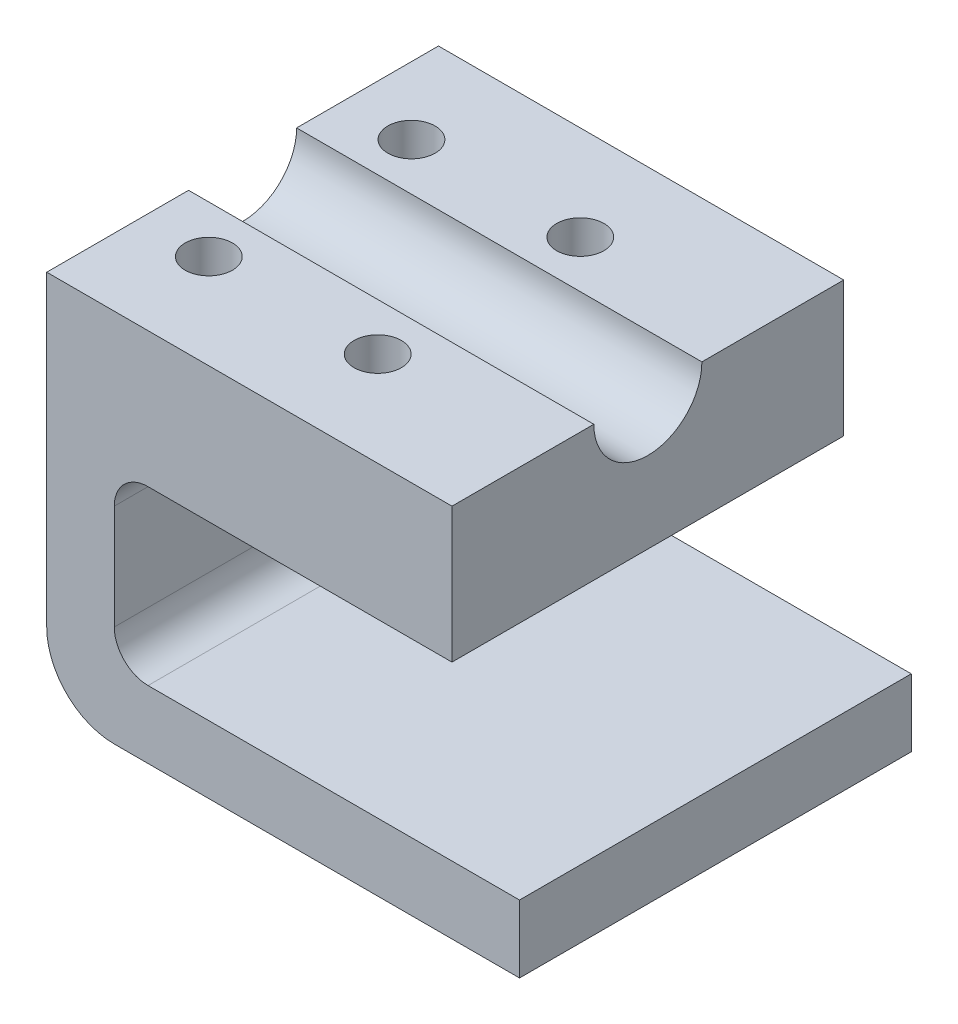
ISO-10303-21;
HEADER;
FILE_DESCRIPTION(('STEP AP214'),'2;1');
FILE_NAME('part.step','',(''),(''),'','','');
FILE_SCHEMA(('AUTOMOTIVE_DESIGN { 1 0 10303 214 1 1 1 1 }'));
ENDSEC;
DATA;
#1=APPLICATION_CONTEXT('core data for automotive mechanical design processes');
#2=APPLICATION_PROTOCOL_DEFINITION('international standard','automotive_design',2000,#1);
#3=PRODUCT_CONTEXT('',#1,'mechanical');
#4=PRODUCT('Part','Part','',(#3));
#5=PRODUCT_RELATED_PRODUCT_CATEGORY('part','',(#4));
#6=PRODUCT_DEFINITION_FORMATION('','',#4);
#7=PRODUCT_DEFINITION_CONTEXT('part definition',#1,'design');
#8=PRODUCT_DEFINITION('design','',#6,#7);
#9=PRODUCT_DEFINITION_SHAPE('','',#8);
#10=(LENGTH_UNIT() NAMED_UNIT(*) SI_UNIT(.MILLI.,.METRE.));
#11=(NAMED_UNIT(*) PLANE_ANGLE_UNIT() SI_UNIT($,.RADIAN.));
#12=(NAMED_UNIT(*) SI_UNIT($,.STERADIAN.) SOLID_ANGLE_UNIT());
#13=UNCERTAINTY_MEASURE_WITH_UNIT(LENGTH_MEASURE(1.E-05),#10,'distance_accuracy_value','');
#14=(GEOMETRIC_REPRESENTATION_CONTEXT(3) GLOBAL_UNCERTAINTY_ASSIGNED_CONTEXT((#13)) GLOBAL_UNIT_ASSIGNED_CONTEXT((#10,
#11,#12)) REPRESENTATION_CONTEXT('',''));
#15=CARTESIAN_POINT('',(0.,0.,0.));
#16=DIRECTION('',(0.,0.,1.));
#17=DIRECTION('',(1.,0.,0.));
#18=AXIS2_PLACEMENT_3D('',#15,#16,#17);
#19=CARTESIAN_POINT('',(-10.,45.5,58.));
#20=DIRECTION('',(0.,-1.,0.));
#21=DIRECTION('',(0.,0.,-1.));
#22=AXIS2_PLACEMENT_3D('',#19,#20,#21);
#23=PLANE('',#22);
#24=CARTESIAN_POINT('',(0.,45.5,44.));
#25=DIRECTION('',(0.,1.,0.));
#26=DIRECTION('',(0.,0.,1.));
#27=AXIS2_PLACEMENT_3D('',#24,#25,#26);
#28=CIRCLE('',#27,3.5);
#29=CARTESIAN_POINT('',(0.,45.5,47.5));
#30=VERTEX_POINT('',#29);
#31=EDGE_CURVE('E305',#30,#30,#28,.T.);
#32=ORIENTED_EDGE('',*,*,#31,.F.);
#33=EDGE_LOOP('',(#32));
#34=FACE_BOUND('',#33,.T.);
#35=CARTESIAN_POINT('',(25.,45.5,44.));
#36=DIRECTION('',(0.,1.,0.));
#37=DIRECTION('',(0.,0.,1.));
#38=AXIS2_PLACEMENT_3D('',#35,#36,#37);
#39=CIRCLE('',#38,3.5);
#40=CARTESIAN_POINT('',(25.,45.5,47.5));
#41=VERTEX_POINT('',#40);
#42=EDGE_CURVE('E315',#41,#41,#39,.T.);
#43=ORIENTED_EDGE('',*,*,#42,.F.);
#44=EDGE_LOOP('',(#43));
#45=FACE_BOUND('',#44,.T.);
#46=DIRECTION('',(0.,0.,-1.));
#47=VECTOR('',#46,1.);
#48=CARTESIAN_POINT('',(50.,45.5,58.));
#49=LINE('',#48,#47);
#50=CARTESIAN_POINT('',(50.,45.5,58.));
#51=VERTEX_POINT('',#50);
#52=CARTESIAN_POINT('',(50.,45.5,37.));
#53=VERTEX_POINT('',#52);
#54=EDGE_CURVE('E149',#51,#53,#49,.T.);
#55=ORIENTED_EDGE('',*,*,#54,.T.);
#56=DIRECTION('',(-1.,0.,0.));
#57=VECTOR('',#56,1.);
#58=CARTESIAN_POINT('',(50.,45.5,37.));
#59=LINE('',#58,#57);
#60=CARTESIAN_POINT('',(-10.,45.5,37.));
#61=VERTEX_POINT('',#60);
#62=EDGE_CURVE('E130',#53,#61,#59,.T.);
#63=ORIENTED_EDGE('',*,*,#62,.T.);
#64=DIRECTION('',(0.,0.,-1.));
#65=VECTOR('',#64,1.);
#66=CARTESIAN_POINT('',(-10.,45.5,58.));
#67=LINE('',#66,#65);
#68=CARTESIAN_POINT('',(-10.,45.5,58.));
#69=VERTEX_POINT('',#68);
#70=EDGE_CURVE('E160',#69,#61,#67,.T.);
#71=ORIENTED_EDGE('',*,*,#70,.F.);
#72=DIRECTION('',(-1.,0.,0.));
#73=VECTOR('',#72,1.);
#74=CARTESIAN_POINT('',(-10.,45.5,58.));
#75=LINE('',#74,#73);
#76=EDGE_CURVE('E155',#51,#69,#75,.T.);
#77=ORIENTED_EDGE('',*,*,#76,.F.);
#78=EDGE_LOOP('',(#55,#63,#71,#77));
#79=FACE_BOUND('',#78,.T.);
#80=ADVANCED_FACE('F37',(#34,#45,#79),#23,.F.);
#81=CARTESIAN_POINT('',(0.,0.,58.));
#82=DIRECTION('',(0.,-1.,0.));
#83=DIRECTION('',(0.,0.,-1.));
#84=AXIS2_PLACEMENT_3D('',#81,#82,#83);
#85=PLANE('',#84);
#86=DIRECTION('',(-1.,0.,0.));
#87=VECTOR('',#86,1.);
#88=CARTESIAN_POINT('',(0.,0.,0.));
#89=LINE('',#88,#87);
#90=CARTESIAN_POINT('',(60.,0.,0.));
#91=VERTEX_POINT('',#90);
#92=CARTESIAN_POINT('',(5.,0.,0.));
#93=VERTEX_POINT('',#92);
#94=EDGE_CURVE('E141',#91,#93,#89,.T.);
#95=ORIENTED_EDGE('',*,*,#94,.T.);
#96=DIRECTION('',(0.,0.,-1.));
#97=VECTOR('',#96,1.);
#98=CARTESIAN_POINT('',(5.,0.,58.));
#99=LINE('',#98,#97);
#100=CARTESIAN_POINT('',(5.,0.,58.));
#101=VERTEX_POINT('',#100);
#102=EDGE_CURVE('E170',#93,#101,#99,.F.);
#103=ORIENTED_EDGE('',*,*,#102,.T.);
#104=DIRECTION('',(-1.,0.,0.));
#105=VECTOR('',#104,1.);
#106=CARTESIAN_POINT('',(0.,0.,58.));
#107=LINE('',#106,#105);
#108=CARTESIAN_POINT('',(60.,0.,58.));
#109=VERTEX_POINT('',#108);
#110=EDGE_CURVE('E199',#109,#101,#107,.T.);
#111=ORIENTED_EDGE('',*,*,#110,.F.);
#112=DIRECTION('',(0.,0.,-1.));
#113=VECTOR('',#112,1.);
#114=CARTESIAN_POINT('',(60.,0.,58.));
#115=LINE('',#114,#113);
#116=EDGE_CURVE('E212',#109,#91,#115,.T.);
#117=ORIENTED_EDGE('',*,*,#116,.T.);
#118=EDGE_LOOP('',(#95,#103,#111,#117));
#119=FACE_BOUND('',#118,.T.);
#120=ADVANCED_FACE('F265',(#119),#85,.F.);
#121=CARTESIAN_POINT('',(0.,0.,58.));
#122=DIRECTION('',(-1.,0.,0.));
#123=DIRECTION('',(0.,0.,1.));
#124=AXIS2_PLACEMENT_3D('',#121,#122,#123);
#125=PLANE('',#124);
#126=DIRECTION('',(0.,1.,0.));
#127=VECTOR('',#126,1.);
#128=CARTESIAN_POINT('',(0.,0.,58.));
#129=LINE('',#128,#127);
#130=CARTESIAN_POINT('',(0.,5.,58.));
#131=VERTEX_POINT('',#130);
#132=CARTESIAN_POINT('',(0.,20.5,58.));
#133=VERTEX_POINT('',#132);
#134=EDGE_CURVE('E196',#131,#133,#129,.T.);
#135=ORIENTED_EDGE('',*,*,#134,.F.);
#136=DIRECTION('',(0.,0.,-1.));
#137=VECTOR('',#136,1.);
#138=CARTESIAN_POINT('',(0.,5.,0.));
#139=LINE('',#138,#137);
#140=CARTESIAN_POINT('',(0.,5.,0.));
#141=VERTEX_POINT('',#140);
#142=EDGE_CURVE('E167',#131,#141,#139,.T.);
#143=ORIENTED_EDGE('',*,*,#142,.T.);
#144=DIRECTION('',(0.,1.,0.));
#145=VECTOR('',#144,1.);
#146=CARTESIAN_POINT('',(0.,0.,0.));
#147=LINE('',#146,#145);
#148=CARTESIAN_POINT('',(0.,20.5,0.));
#149=VERTEX_POINT('',#148);
#150=EDGE_CURVE('E183',#141,#149,#147,.T.);
#151=ORIENTED_EDGE('',*,*,#150,.T.);
#152=DIRECTION('',(0.,0.,-1.));
#153=VECTOR('',#152,1.);
#154=CARTESIAN_POINT('',(0.,20.5,58.));
#155=LINE('',#154,#153);
#156=EDGE_CURVE('E165',#149,#133,#155,.F.);
#157=ORIENTED_EDGE('',*,*,#156,.T.);
#158=EDGE_LOOP('',(#135,#143,#151,#157));
#159=FACE_BOUND('',#158,.T.);
#160=ADVANCED_FACE('F188',(#159),#125,.F.);
#161=CARTESIAN_POINT('',(0.,25.5,58.));
#162=DIRECTION('',(0.,1.,0.));
#163=DIRECTION('',(0.,0.,1.));
#164=AXIS2_PLACEMENT_3D('',#161,#162,#163);
#165=PLANE('',#164);
#166=DIRECTION('',(1.,0.,0.));
#167=VECTOR('',#166,1.);
#168=CARTESIAN_POINT('',(0.,25.5,58.));
#169=LINE('',#168,#167);
#170=CARTESIAN_POINT('',(5.,25.5,58.));
#171=VERTEX_POINT('',#170);
#172=CARTESIAN_POINT('',(50.,25.5,58.));
#173=VERTEX_POINT('',#172);
#174=EDGE_CURVE('E194',#171,#173,#169,.T.);
#175=ORIENTED_EDGE('',*,*,#174,.F.);
#176=DIRECTION('',(0.,0.,-1.));
#177=VECTOR('',#176,1.);
#178=CARTESIAN_POINT('',(5.,25.5,0.));
#179=LINE('',#178,#177);
#180=CARTESIAN_POINT('',(5.,25.5,0.));
#181=VERTEX_POINT('',#180);
#182=EDGE_CURVE('E172',#171,#181,#179,.T.);
#183=ORIENTED_EDGE('',*,*,#182,.T.);
#184=DIRECTION('',(1.,0.,0.));
#185=VECTOR('',#184,1.);
#186=CARTESIAN_POINT('',(0.,25.5,0.));
#187=LINE('',#186,#185);
#188=CARTESIAN_POINT('',(50.,25.5,0.));
#189=VERTEX_POINT('',#188);
#190=EDGE_CURVE('E185',#181,#189,#187,.T.);
#191=ORIENTED_EDGE('',*,*,#190,.T.);
#192=DIRECTION('',(0.,0.,-1.));
#193=VECTOR('',#192,1.);
#194=CARTESIAN_POINT('',(50.,25.5,58.));
#195=LINE('',#194,#193);
#196=EDGE_CURVE('E156',#173,#189,#195,.T.);
#197=ORIENTED_EDGE('',*,*,#196,.F.);
#198=EDGE_LOOP('',(#175,#183,#191,#197));
#199=FACE_BOUND('',#198,.T.);
#200=ADVANCED_FACE('F192',(#199),#165,.F.);
#201=CARTESIAN_POINT('',(50.,25.5,58.));
#202=DIRECTION('',(-1.,0.,0.));
#203=DIRECTION('',(0.,0.,1.));
#204=AXIS2_PLACEMENT_3D('',#201,#202,#203);
#205=PLANE('',#204);
#206=CARTESIAN_POINT('',(50.,45.5,21.));
#207=VERTEX_POINT('',#206);
#208=CARTESIAN_POINT('',(50.,45.5,0.));
#209=VERTEX_POINT('',#208);
#210=EDGE_CURVE('E152',#207,#209,#49,.T.);
#211=ORIENTED_EDGE('',*,*,#210,.F.);
#212=CARTESIAN_POINT('',(50.,45.5,29.));
#213=DIRECTION('',(-1.,0.,0.));
#214=DIRECTION('',(0.,0.,1.));
#215=AXIS2_PLACEMENT_3D('',#212,#213,#214);
#216=CIRCLE('',#215,7.99999999999999);
#217=EDGE_CURVE('E133',#207,#53,#216,.T.);
#218=ORIENTED_EDGE('',*,*,#217,.T.);
#219=ORIENTED_EDGE('',*,*,#54,.F.);
#220=DIRECTION('',(0.,1.,0.));
#221=VECTOR('',#220,1.);
#222=CARTESIAN_POINT('',(50.,25.5,58.));
#223=LINE('',#222,#221);
#224=EDGE_CURVE('E195',#173,#51,#223,.T.);
#225=ORIENTED_EDGE('',*,*,#224,.F.);
#226=ORIENTED_EDGE('',*,*,#196,.T.);
#227=DIRECTION('',(0.,1.,0.));
#228=VECTOR('',#227,1.);
#229=CARTESIAN_POINT('',(50.,25.5,0.));
#230=LINE('',#229,#228);
#231=EDGE_CURVE('E216',#189,#209,#230,.T.);
#232=ORIENTED_EDGE('',*,*,#231,.T.);
#233=EDGE_LOOP('',(#211,#218,#219,#225,#226,#232));
#234=FACE_BOUND('',#233,.T.);
#235=ADVANCED_FACE('F147',(#234),#205,.F.);
#236=CARTESIAN_POINT('',(25.,45.5,14.));
#237=DIRECTION('',(0.,1.,0.));
#238=DIRECTION('',(0.,0.,1.));
#239=AXIS2_PLACEMENT_3D('',#236,#237,#238);
#240=CIRCLE('',#239,3.5);
#241=CARTESIAN_POINT('',(25.,45.5,17.5));
#242=VERTEX_POINT('',#241);
#243=EDGE_CURVE('E300',#242,#242,#240,.T.);
#244=ORIENTED_EDGE('',*,*,#243,.F.);
#245=EDGE_LOOP('',(#244));
#246=FACE_BOUND('',#245,.T.);
#247=CARTESIAN_POINT('',(0.,45.5,14.));
#248=DIRECTION('',(0.,1.,0.));
#249=DIRECTION('',(0.,0.,1.));
#250=AXIS2_PLACEMENT_3D('',#247,#248,#249);
#251=CIRCLE('',#250,3.5);
#252=CARTESIAN_POINT('',(0.,45.5,17.5));
#253=VERTEX_POINT('',#252);
#254=EDGE_CURVE('E303',#253,#253,#251,.T.);
#255=ORIENTED_EDGE('',*,*,#254,.F.);
#256=EDGE_LOOP('',(#255));
#257=FACE_BOUND('',#256,.T.);
#258=CARTESIAN_POINT('',(-10.,45.5,21.));
#259=VERTEX_POINT('',#258);
#260=CARTESIAN_POINT('',(-10.,45.5,0.));
#261=VERTEX_POINT('',#260);
#262=EDGE_CURVE('E238',#259,#261,#67,.T.);
#263=ORIENTED_EDGE('',*,*,#262,.F.);
#264=DIRECTION('',(-1.,0.,0.));
#265=VECTOR('',#264,1.);
#266=CARTESIAN_POINT('',(50.,45.5,21.));
#267=LINE('',#266,#265);
#268=EDGE_CURVE('E142',#259,#207,#267,.F.);
#269=ORIENTED_EDGE('',*,*,#268,.T.);
#270=ORIENTED_EDGE('',*,*,#210,.T.);
#271=DIRECTION('',(-1.,0.,0.));
#272=VECTOR('',#271,1.);
#273=CARTESIAN_POINT('',(-10.,45.5,0.));
#274=LINE('',#273,#272);
#275=EDGE_CURVE('E218',#209,#261,#274,.T.);
#276=ORIENTED_EDGE('',*,*,#275,.T.);
#277=EDGE_LOOP('',(#263,#269,#270,#276));
#278=FACE_BOUND('',#277,.T.);
#279=ADVANCED_FACE('F253',(#246,#257,#278),#23,.F.);
#280=CARTESIAN_POINT('',(-10.,0.,58.));
#281=DIRECTION('',(1.,0.,0.));
#282=DIRECTION('',(0.,0.,-1.));
#283=AXIS2_PLACEMENT_3D('',#280,#281,#282);
#284=PLANE('',#283);
#285=ORIENTED_EDGE('',*,*,#70,.T.);
#286=CARTESIAN_POINT('',(-10.,45.5,29.));
#287=DIRECTION('',(1.,0.,0.));
#288=DIRECTION('',(0.,0.,-1.));
#289=AXIS2_PLACEMENT_3D('',#286,#287,#288);
#290=CIRCLE('',#289,7.99999999999999);
#291=EDGE_CURVE('E136',#61,#259,#290,.T.);
#292=ORIENTED_EDGE('',*,*,#291,.T.);
#293=ORIENTED_EDGE('',*,*,#262,.T.);
#294=DIRECTION('',(0.,-1.,0.));
#295=VECTOR('',#294,1.);
#296=CARTESIAN_POINT('',(-10.,0.,0.));
#297=LINE('',#296,#295);
#298=CARTESIAN_POINT('',(-10.,0.,0.));
#299=VERTEX_POINT('',#298);
#300=EDGE_CURVE('E221',#261,#299,#297,.T.);
#301=ORIENTED_EDGE('',*,*,#300,.T.);
#302=DIRECTION('',(0.,0.,-1.));
#303=VECTOR('',#302,1.);
#304=CARTESIAN_POINT('',(-10.,0.,58.));
#305=LINE('',#304,#303);
#306=CARTESIAN_POINT('',(-10.,0.,58.));
#307=VERTEX_POINT('',#306);
#308=EDGE_CURVE('E236',#307,#299,#305,.T.);
#309=ORIENTED_EDGE('',*,*,#308,.F.);
#310=DIRECTION('',(0.,-1.,0.));
#311=VECTOR('',#310,1.);
#312=CARTESIAN_POINT('',(-10.,0.,58.));
#313=LINE('',#312,#311);
#314=EDGE_CURVE('E204',#69,#307,#313,.T.);
#315=ORIENTED_EDGE('',*,*,#314,.F.);
#316=EDGE_LOOP('',(#285,#292,#293,#301,#309,#315));
#317=FACE_BOUND('',#316,.T.);
#318=ADVANCED_FACE('F246',(#317),#284,.F.);
#319=CARTESIAN_POINT('',(0.,0.,58.));
#320=DIRECTION('',(0.,0.,-1.));
#321=DIRECTION('',(-1.,0.,0.));
#322=AXIS2_PLACEMENT_3D('',#319,#320,#321);
#323=CYLINDRICAL_SURFACE('',#322,10.);
#324=CARTESIAN_POINT('',(0.,0.,0.));
#325=DIRECTION('',(0.,0.,1.));
#326=DIRECTION('',(1.,0.,0.));
#327=AXIS2_PLACEMENT_3D('',#324,#325,#326);
#328=CIRCLE('',#327,10.);
#329=CARTESIAN_POINT('',(0.,-10.,0.));
#330=VERTEX_POINT('',#329);
#331=EDGE_CURVE('E223',#299,#330,#328,.T.);
#332=ORIENTED_EDGE('',*,*,#331,.T.);
#333=DIRECTION('',(0.,0.,-1.));
#334=VECTOR('',#333,1.);
#335=CARTESIAN_POINT('',(0.,-10.,58.));
#336=LINE('',#335,#334);
#337=CARTESIAN_POINT('',(0.,-10.,58.));
#338=VERTEX_POINT('',#337);
#339=EDGE_CURVE('E234',#338,#330,#336,.T.);
#340=ORIENTED_EDGE('',*,*,#339,.F.);
#341=CARTESIAN_POINT('',(0.,0.,58.));
#342=DIRECTION('',(0.,0.,1.));
#343=DIRECTION('',(1.,0.,0.));
#344=AXIS2_PLACEMENT_3D('',#341,#342,#343);
#345=CIRCLE('',#344,10.);
#346=EDGE_CURVE('E206',#307,#338,#345,.T.);
#347=ORIENTED_EDGE('',*,*,#346,.F.);
#348=ORIENTED_EDGE('',*,*,#308,.T.);
#349=EDGE_LOOP('',(#332,#340,#347,#348));
#350=FACE_BOUND('',#349,.T.);
#351=ADVANCED_FACE('F273',(#350),#323,.T.);
#352=CARTESIAN_POINT('',(0.,-10.,58.));
#353=DIRECTION('',(0.,1.,0.));
#354=DIRECTION('',(0.,0.,1.));
#355=AXIS2_PLACEMENT_3D('',#352,#353,#354);
#356=PLANE('',#355);
#357=DIRECTION('',(1.,0.,0.));
#358=VECTOR('',#357,1.);
#359=CARTESIAN_POINT('',(0.,-10.,0.));
#360=LINE('',#359,#358);
#361=CARTESIAN_POINT('',(60.,-10.,0.));
#362=VERTEX_POINT('',#361);
#363=EDGE_CURVE('E225',#330,#362,#360,.T.);
#364=ORIENTED_EDGE('',*,*,#363,.T.);
#365=DIRECTION('',(0.,0.,-1.));
#366=VECTOR('',#365,1.);
#367=CARTESIAN_POINT('',(60.,-10.,58.));
#368=LINE('',#367,#366);
#369=CARTESIAN_POINT('',(60.,-10.,58.));
#370=VERTEX_POINT('',#369);
#371=EDGE_CURVE('E231',#370,#362,#368,.T.);
#372=ORIENTED_EDGE('',*,*,#371,.F.);
#373=DIRECTION('',(1.,0.,0.));
#374=VECTOR('',#373,1.);
#375=CARTESIAN_POINT('',(0.,-10.,58.));
#376=LINE('',#375,#374);
#377=EDGE_CURVE('E208',#338,#370,#376,.T.);
#378=ORIENTED_EDGE('',*,*,#377,.F.);
#379=ORIENTED_EDGE('',*,*,#339,.T.);
#380=EDGE_LOOP('',(#364,#372,#378,#379));
#381=FACE_BOUND('',#380,.T.);
#382=ADVANCED_FACE('F271',(#381),#356,.F.);
#383=CARTESIAN_POINT('',(60.,0.,58.));
#384=DIRECTION('',(-1.,0.,0.));
#385=DIRECTION('',(0.,0.,1.));
#386=AXIS2_PLACEMENT_3D('',#383,#384,#385);
#387=PLANE('',#386);
#388=DIRECTION('',(0.,1.,0.));
#389=VECTOR('',#388,1.);
#390=CARTESIAN_POINT('',(60.,0.,0.));
#391=LINE('',#390,#389);
#392=EDGE_CURVE('E227',#362,#91,#391,.T.);
#393=ORIENTED_EDGE('',*,*,#392,.T.);
#394=ORIENTED_EDGE('',*,*,#116,.F.);
#395=DIRECTION('',(0.,1.,0.));
#396=VECTOR('',#395,1.);
#397=CARTESIAN_POINT('',(60.,0.,58.));
#398=LINE('',#397,#396);
#399=EDGE_CURVE('E210',#370,#109,#398,.T.);
#400=ORIENTED_EDGE('',*,*,#399,.F.);
#401=ORIENTED_EDGE('',*,*,#371,.T.);
#402=EDGE_LOOP('',(#393,#394,#400,#401));
#403=FACE_BOUND('',#402,.T.);
#404=ADVANCED_FACE('F267',(#403),#387,.F.);
#405=CARTESIAN_POINT('',(0.,0.,58.));
#406=DIRECTION('',(0.,0.,1.));
#407=DIRECTION('',(1.,0.,0.));
#408=AXIS2_PLACEMENT_3D('',#405,#406,#407);
#409=PLANE('',#408);
#410=ORIENTED_EDGE('',*,*,#110,.T.);
#411=CARTESIAN_POINT('',(5.,5.,58.));
#412=DIRECTION('',(0.,0.,1.));
#413=DIRECTION('',(1.,0.,0.));
#414=AXIS2_PLACEMENT_3D('',#411,#412,#413);
#415=CIRCLE('',#414,5.);
#416=EDGE_CURVE('E176',#101,#131,#415,.F.);
#417=ORIENTED_EDGE('',*,*,#416,.T.);
#418=ORIENTED_EDGE('',*,*,#134,.T.);
#419=CARTESIAN_POINT('',(5.,20.5,58.));
#420=DIRECTION('',(0.,0.,1.));
#421=DIRECTION('',(1.,0.,0.));
#422=AXIS2_PLACEMENT_3D('',#419,#420,#421);
#423=CIRCLE('',#422,5.);
#424=EDGE_CURVE('E11',#133,#171,#423,.F.);
#425=ORIENTED_EDGE('',*,*,#424,.T.);
#426=ORIENTED_EDGE('',*,*,#174,.T.);
#427=ORIENTED_EDGE('',*,*,#224,.T.);
#428=ORIENTED_EDGE('',*,*,#76,.T.);
#429=ORIENTED_EDGE('',*,*,#314,.T.);
#430=ORIENTED_EDGE('',*,*,#346,.T.);
#431=ORIENTED_EDGE('',*,*,#377,.T.);
#432=ORIENTED_EDGE('',*,*,#399,.T.);
#433=EDGE_LOOP('',(#410,#417,#418,#425,#426,#427,#428,#429,#430,#431,#432));
#434=FACE_BOUND('',#433,.T.);
#435=ADVANCED_FACE('F248',(#434),#409,.T.);
#436=CARTESIAN_POINT('',(0.,0.,0.));
#437=DIRECTION('',(0.,0.,1.));
#438=DIRECTION('',(1.,0.,0.));
#439=AXIS2_PLACEMENT_3D('',#436,#437,#438);
#440=PLANE('',#439);
#441=ORIENTED_EDGE('',*,*,#94,.F.);
#442=ORIENTED_EDGE('',*,*,#392,.F.);
#443=ORIENTED_EDGE('',*,*,#363,.F.);
#444=ORIENTED_EDGE('',*,*,#331,.F.);
#445=ORIENTED_EDGE('',*,*,#300,.F.);
#446=ORIENTED_EDGE('',*,*,#275,.F.);
#447=ORIENTED_EDGE('',*,*,#231,.F.);
#448=ORIENTED_EDGE('',*,*,#190,.F.);
#449=CARTESIAN_POINT('',(5.,20.5,0.));
#450=DIRECTION('',(0.,0.,1.));
#451=DIRECTION('',(1.,0.,0.));
#452=AXIS2_PLACEMENT_3D('',#449,#450,#451);
#453=CIRCLE('',#452,5.);
#454=EDGE_CURVE('E45',#181,#149,#453,.T.);
#455=ORIENTED_EDGE('',*,*,#454,.T.);
#456=ORIENTED_EDGE('',*,*,#150,.F.);
#457=CARTESIAN_POINT('',(5.,5.,0.));
#458=DIRECTION('',(0.,0.,1.));
#459=DIRECTION('',(1.,0.,0.));
#460=AXIS2_PLACEMENT_3D('',#457,#458,#459);
#461=CIRCLE('',#460,5.);
#462=EDGE_CURVE('E174',#141,#93,#461,.T.);
#463=ORIENTED_EDGE('',*,*,#462,.T.);
#464=EDGE_LOOP('',(#441,#442,#443,#444,#445,#446,#447,#448,#455,#456,#463));
#465=FACE_BOUND('',#464,.T.);
#466=ADVANCED_FACE('F182',(#465),#440,.F.);
#467=CARTESIAN_POINT('',(50.,45.5,29.));
#468=DIRECTION('',(-1.,0.,0.));
#469=DIRECTION('',(0.,0.,1.));
#470=AXIS2_PLACEMENT_3D('',#467,#468,#469);
#471=CYLINDRICAL_SURFACE('',#470,7.99999999999999);
#472=ORIENTED_EDGE('',*,*,#217,.F.);
#473=ORIENTED_EDGE('',*,*,#268,.F.);
#474=ORIENTED_EDGE('',*,*,#291,.F.);
#475=ORIENTED_EDGE('',*,*,#62,.F.);
#476=EDGE_LOOP('',(#472,#473,#474,#475));
#477=FACE_BOUND('',#476,.T.);
#478=ADVANCED_FACE('F132',(#477),#471,.F.);
#479=CARTESIAN_POINT('',(0.,27.5,14.));
#480=DIRECTION('',(0.,1.,0.));
#481=DIRECTION('',(0.,0.,1.));
#482=AXIS2_PLACEMENT_3D('',#479,#480,#481);
#483=CYLINDRICAL_SURFACE('',#482,3.5);
#484=CARTESIAN_POINT('',(0.,27.5,14.));
#485=DIRECTION('',(0.,1.,0.));
#486=DIRECTION('',(0.,0.,1.));
#487=AXIS2_PLACEMENT_3D('',#484,#485,#486);
#488=CIRCLE('',#487,3.5);
#489=CARTESIAN_POINT('',(0.,27.5,17.5));
#490=VERTEX_POINT('',#489);
#491=EDGE_CURVE('E153',#490,#490,#488,.T.);
#492=ORIENTED_EDGE('',*,*,#491,.F.);
#493=EDGE_LOOP('',(#492));
#494=FACE_BOUND('',#493,.T.);
#495=ORIENTED_EDGE('',*,*,#254,.T.);
#496=EDGE_LOOP('',(#495));
#497=FACE_BOUND('',#496,.T.);
#498=ADVANCED_FACE('F356',(#494,#497),#483,.F.);
#499=CARTESIAN_POINT('',(0.,27.5,14.));
#500=DIRECTION('',(0.,1.,0.));
#501=DIRECTION('',(0.,0.,1.));
#502=AXIS2_PLACEMENT_3D('',#499,#500,#501);
#503=PLANE('',#502);
#504=ORIENTED_EDGE('',*,*,#491,.T.);
#505=EDGE_LOOP('',(#504));
#506=FACE_BOUND('',#505,.T.);
#507=ADVANCED_FACE('F351',(#506),#503,.T.);
#508=CARTESIAN_POINT('',(25.,27.5,14.));
#509=DIRECTION('',(0.,1.,0.));
#510=DIRECTION('',(0.,0.,1.));
#511=AXIS2_PLACEMENT_3D('',#508,#509,#510);
#512=CYLINDRICAL_SURFACE('',#511,3.5);
#513=CARTESIAN_POINT('',(25.,27.5,14.));
#514=DIRECTION('',(0.,1.,0.));
#515=DIRECTION('',(0.,0.,1.));
#516=AXIS2_PLACEMENT_3D('',#513,#514,#515);
#517=CIRCLE('',#516,3.5);
#518=CARTESIAN_POINT('',(25.,27.5,17.5));
#519=VERTEX_POINT('',#518);
#520=EDGE_CURVE('E312',#519,#519,#517,.T.);
#521=ORIENTED_EDGE('',*,*,#520,.F.);
#522=EDGE_LOOP('',(#521));
#523=FACE_BOUND('',#522,.T.);
#524=ORIENTED_EDGE('',*,*,#243,.T.);
#525=EDGE_LOOP('',(#524));
#526=FACE_BOUND('',#525,.T.);
#527=ADVANCED_FACE('F338',(#523,#526),#512,.F.);
#528=CARTESIAN_POINT('',(25.,27.5,14.));
#529=DIRECTION('',(0.,1.,0.));
#530=DIRECTION('',(0.,0.,1.));
#531=AXIS2_PLACEMENT_3D('',#528,#529,#530);
#532=PLANE('',#531);
#533=ORIENTED_EDGE('',*,*,#520,.T.);
#534=EDGE_LOOP('',(#533));
#535=FACE_BOUND('',#534,.T.);
#536=ADVANCED_FACE('F328',(#535),#532,.T.);
#537=CARTESIAN_POINT('',(25.,27.5,44.));
#538=DIRECTION('',(0.,1.,0.));
#539=DIRECTION('',(0.,0.,1.));
#540=AXIS2_PLACEMENT_3D('',#537,#538,#539);
#541=CYLINDRICAL_SURFACE('',#540,3.5);
#542=CARTESIAN_POINT('',(25.,27.5,44.));
#543=DIRECTION('',(0.,1.,0.));
#544=DIRECTION('',(0.,0.,1.));
#545=AXIS2_PLACEMENT_3D('',#542,#543,#544);
#546=CIRCLE('',#545,3.5);
#547=CARTESIAN_POINT('',(25.,27.5,47.5));
#548=VERTEX_POINT('',#547);
#549=EDGE_CURVE('E319',#548,#548,#546,.T.);
#550=ORIENTED_EDGE('',*,*,#549,.F.);
#551=EDGE_LOOP('',(#550));
#552=FACE_BOUND('',#551,.T.);
#553=ORIENTED_EDGE('',*,*,#42,.T.);
#554=EDGE_LOOP('',(#553));
#555=FACE_BOUND('',#554,.T.);
#556=ADVANCED_FACE('F325',(#552,#555),#541,.F.);
#557=CARTESIAN_POINT('',(25.,27.5,44.));
#558=DIRECTION('',(0.,1.,0.));
#559=DIRECTION('',(0.,0.,1.));
#560=AXIS2_PLACEMENT_3D('',#557,#558,#559);
#561=PLANE('',#560);
#562=ORIENTED_EDGE('',*,*,#549,.T.);
#563=EDGE_LOOP('',(#562));
#564=FACE_BOUND('',#563,.T.);
#565=ADVANCED_FACE('F327',(#564),#561,.T.);
#566=CARTESIAN_POINT('',(0.,27.5,44.));
#567=DIRECTION('',(0.,1.,0.));
#568=DIRECTION('',(0.,0.,1.));
#569=AXIS2_PLACEMENT_3D('',#566,#567,#568);
#570=CYLINDRICAL_SURFACE('',#569,3.5);
#571=CARTESIAN_POINT('',(0.,27.5,44.));
#572=DIRECTION('',(0.,1.,0.));
#573=DIRECTION('',(0.,0.,1.));
#574=AXIS2_PLACEMENT_3D('',#571,#572,#573);
#575=CIRCLE('',#574,3.5);
#576=CARTESIAN_POINT('',(0.,27.5,47.5));
#577=VERTEX_POINT('',#576);
#578=EDGE_CURVE('E309',#577,#577,#575,.T.);
#579=ORIENTED_EDGE('',*,*,#578,.F.);
#580=EDGE_LOOP('',(#579));
#581=FACE_BOUND('',#580,.T.);
#582=ORIENTED_EDGE('',*,*,#31,.T.);
#583=EDGE_LOOP('',(#582));
#584=FACE_BOUND('',#583,.T.);
#585=ADVANCED_FACE('F335',(#581,#584),#570,.F.);
#586=CARTESIAN_POINT('',(0.,27.5,44.));
#587=DIRECTION('',(0.,1.,0.));
#588=DIRECTION('',(0.,0.,1.));
#589=AXIS2_PLACEMENT_3D('',#586,#587,#588);
#590=PLANE('',#589);
#591=ORIENTED_EDGE('',*,*,#578,.T.);
#592=EDGE_LOOP('',(#591));
#593=FACE_BOUND('',#592,.T.);
#594=ADVANCED_FACE('F345',(#593),#590,.T.);
#595=CARTESIAN_POINT('',(5.,5.,58.));
#596=DIRECTION('',(0.,0.,1.));
#597=DIRECTION('',(1.,0.,0.));
#598=AXIS2_PLACEMENT_3D('',#595,#596,#597);
#599=CYLINDRICAL_SURFACE('',#598,5.);
#600=ORIENTED_EDGE('',*,*,#416,.F.);
#601=ORIENTED_EDGE('',*,*,#102,.F.);
#602=ORIENTED_EDGE('',*,*,#462,.F.);
#603=ORIENTED_EDGE('',*,*,#142,.F.);
#604=EDGE_LOOP('',(#600,#601,#602,#603));
#605=FACE_BOUND('',#604,.T.);
#606=ADVANCED_FACE('F263',(#605),#599,.F.);
#607=CARTESIAN_POINT('',(5.,20.5,58.));
#608=DIRECTION('',(0.,0.,1.));
#609=DIRECTION('',(1.,0.,0.));
#610=AXIS2_PLACEMENT_3D('',#607,#608,#609);
#611=CYLINDRICAL_SURFACE('',#610,5.);
#612=ORIENTED_EDGE('',*,*,#424,.F.);
#613=ORIENTED_EDGE('',*,*,#156,.F.);
#614=ORIENTED_EDGE('',*,*,#454,.F.);
#615=ORIENTED_EDGE('',*,*,#182,.F.);
#616=EDGE_LOOP('',(#612,#613,#614,#615));
#617=FACE_BOUND('',#616,.T.);
#618=ADVANCED_FACE('F39',(#617),#611,.F.);
#619=CLOSED_SHELL('',(#80,#120,#160,#200,#235,#279,#318,#351,#382,#404,#435,#466,#478,#498,#507,
#527,#536,#556,#565,#585,#594,#606,#618));
#620=MANIFOLD_SOLID_BREP('B2',#619);
#621=ADVANCED_BREP_SHAPE_REPRESENTATION('',(#18,#620),#14);
#622=SHAPE_DEFINITION_REPRESENTATION(#9,#621);
ENDSEC;
END-ISO-10303-21;
